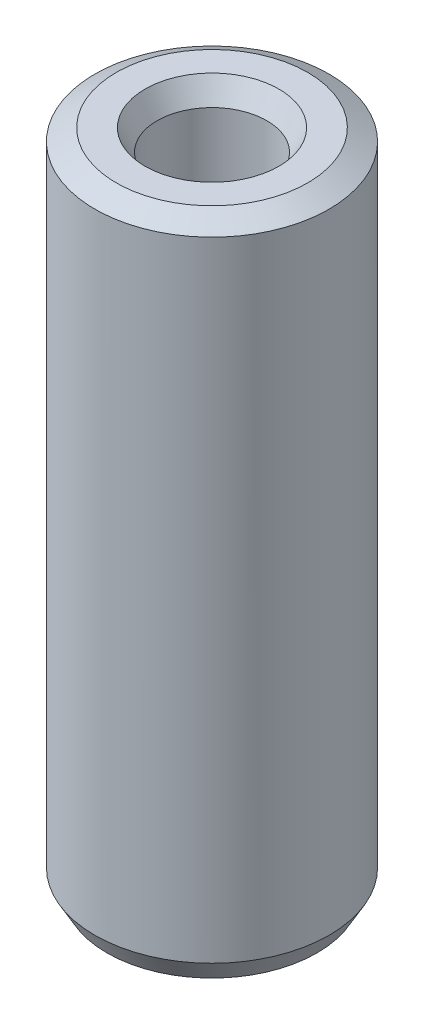
ISO-10303-21;
HEADER;
FILE_DESCRIPTION(('STEP AP214'),'2;1');
FILE_NAME('part.step','',(''),(''),'','','');
FILE_SCHEMA(('AUTOMOTIVE_DESIGN { 1 0 10303 214 1 1 1 1 }'));
ENDSEC;
DATA;
#1=APPLICATION_CONTEXT('core data for automotive mechanical design processes');
#2=APPLICATION_PROTOCOL_DEFINITION('international standard','automotive_design',2000,#1);
#3=PRODUCT_CONTEXT('',#1,'mechanical');
#4=PRODUCT('Part','Part','',(#3));
#5=PRODUCT_RELATED_PRODUCT_CATEGORY('part','',(#4));
#6=PRODUCT_DEFINITION_FORMATION('','',#4);
#7=PRODUCT_DEFINITION_CONTEXT('part definition',#1,'design');
#8=PRODUCT_DEFINITION('design','',#6,#7);
#9=PRODUCT_DEFINITION_SHAPE('','',#8);
#10=(LENGTH_UNIT() NAMED_UNIT(*) SI_UNIT(.MILLI.,.METRE.));
#11=(NAMED_UNIT(*) PLANE_ANGLE_UNIT() SI_UNIT($,.RADIAN.));
#12=(NAMED_UNIT(*) SI_UNIT($,.STERADIAN.) SOLID_ANGLE_UNIT());
#13=UNCERTAINTY_MEASURE_WITH_UNIT(LENGTH_MEASURE(1.E-05),#10,'distance_accuracy_value','');
#14=(GEOMETRIC_REPRESENTATION_CONTEXT(3) GLOBAL_UNCERTAINTY_ASSIGNED_CONTEXT((#13)) GLOBAL_UNIT_ASSIGNED_CONTEXT((#10,
#11,#12)) REPRESENTATION_CONTEXT('',''));
#15=CARTESIAN_POINT('',(0.,0.,0.));
#16=DIRECTION('',(0.,0.,1.));
#17=DIRECTION('',(1.,0.,0.));
#18=AXIS2_PLACEMENT_3D('',#15,#16,#17);
#19=CARTESIAN_POINT('',(0.,212.09904631612,0.));
#20=DIRECTION('',(0.,-1.,0.));
#21=DIRECTION('',(0.,0.,-1.));
#22=AXIS2_PLACEMENT_3D('',#19,#20,#21);
#23=CYLINDRICAL_SURFACE('',#22,37.5);
#24=CARTESIAN_POINT('',(0.,6.8413679712053,0.));
#25=DIRECTION('',(0.,1.,0.));
#26=DIRECTION('',(0.,0.,1.));
#27=AXIS2_PLACEMENT_3D('',#24,#25,#26);
#28=CIRCLE('',#27,37.5);
#29=CARTESIAN_POINT('',(0.,6.8413679712053,37.5));
#30=VERTEX_POINT('',#29);
#31=EDGE_CURVE('E10',#30,#30,#28,.T.);
#32=ORIENTED_EDGE('',*,*,#31,.T.);
#33=EDGE_LOOP('',(#32));
#34=FACE_BOUND('',#33,.T.);
#35=CARTESIAN_POINT('',(0.,208.230905599454,0.));
#36=DIRECTION('',(0.,1.,0.));
#37=DIRECTION('',(0.,0.,1.));
#38=AXIS2_PLACEMENT_3D('',#35,#36,#37);
#39=CIRCLE('',#38,37.5);
#40=CARTESIAN_POINT('',(0.,208.230905599454,-37.5));
#41=VERTEX_POINT('',#40);
#42=EDGE_CURVE('E50',#41,#41,#39,.F.);
#43=ORIENTED_EDGE('',*,*,#42,.T.);
#44=EDGE_LOOP('',(#43));
#45=FACE_BOUND('',#44,.T.);
#46=ADVANCED_FACE('F39',(#34,#45),#23,.T.);
#47=CARTESIAN_POINT('',(0.,212.09904631612,0.));
#48=DIRECTION('',(0.,1.,0.));
#49=DIRECTION('',(0.,0.,1.));
#50=AXIS2_PLACEMENT_3D('',#47,#48,#49);
#51=PLANE('',#50);
#52=CARTESIAN_POINT('',(0.,212.09904631612,0.));
#53=DIRECTION('',(0.,1.,0.));
#54=DIRECTION('',(0.,0.,1.));
#55=AXIS2_PLACEMENT_3D('',#52,#53,#54);
#56=CIRCLE('',#55,21.4346410003308);
#57=CARTESIAN_POINT('',(0.,212.09904631612,21.4346410003308));
#58=VERTEX_POINT('',#57);
#59=EDGE_CURVE('E58',#58,#58,#56,.F.);
#60=ORIENTED_EDGE('',*,*,#59,.T.);
#61=EDGE_LOOP('',(#60));
#62=FACE_BOUND('',#61,.T.);
#63=CARTESIAN_POINT('',(0.,212.09904631612,0.));
#64=DIRECTION('',(0.,1.,0.));
#65=DIRECTION('',(0.,0.,1.));
#66=AXIS2_PLACEMENT_3D('',#63,#64,#65);
#67=CIRCLE('',#66,30.6586320287946);
#68=CARTESIAN_POINT('',(0.,212.09904631612,-30.6586320287946));
#69=VERTEX_POINT('',#68);
#70=EDGE_CURVE('E61',#69,#69,#67,.T.);
#71=ORIENTED_EDGE('',*,*,#70,.T.);
#72=EDGE_LOOP('',(#71));
#73=FACE_BOUND('',#72,.T.);
#74=ADVANCED_FACE('F88',(#62,#73),#51,.T.);
#75=CARTESIAN_POINT('',(0.,0.,0.));
#76=DIRECTION('',(0.,1.,0.));
#77=DIRECTION('',(0.,0.,1.));
#78=AXIS2_PLACEMENT_3D('',#75,#76,#77);
#79=PLANE('',#78);
#80=CARTESIAN_POINT('',(0.,0.,0.));
#81=DIRECTION('',(0.,1.,0.));
#82=DIRECTION('',(0.,0.,1.));
#83=AXIS2_PLACEMENT_3D('',#80,#81,#82);
#84=CIRCLE('',#83,24.4078682548698);
#85=CARTESIAN_POINT('',(0.,0.,24.4078682548698));
#86=VERTEX_POINT('',#85);
#87=EDGE_CURVE('E51',#86,#86,#84,.T.);
#88=ORIENTED_EDGE('',*,*,#87,.T.);
#89=EDGE_LOOP('',(#88));
#90=FACE_BOUND('',#89,.T.);
#91=CARTESIAN_POINT('',(0.,0.,0.));
#92=DIRECTION('',(0.,1.,0.));
#93=DIRECTION('',(0.,0.,1.));
#94=AXIS2_PLACEMENT_3D('',#91,#92,#93);
#95=CIRCLE('',#94,33.6318592833337);
#96=CARTESIAN_POINT('',(0.,0.,33.6318592833337));
#97=VERTEX_POINT('',#96);
#98=EDGE_CURVE('E54',#97,#97,#95,.F.);
#99=ORIENTED_EDGE('',*,*,#98,.T.);
#100=EDGE_LOOP('',(#99));
#101=FACE_BOUND('',#100,.T.);
#102=ADVANCED_FACE('F83',(#90,#101),#79,.F.);
#103=CARTESIAN_POINT('',(0.,212.09904631612,0.));
#104=DIRECTION('',(0.,-1.,0.));
#105=DIRECTION('',(0.,0.,-1.));
#106=AXIS2_PLACEMENT_3D('',#103,#104,#105);
#107=CYLINDRICAL_SURFACE('',#106,17.5665002836644);
#108=CARTESIAN_POINT('',(0.,205.257678344915,0.));
#109=DIRECTION('',(0.,1.,0.));
#110=DIRECTION('',(0.,0.,1.));
#111=AXIS2_PLACEMENT_3D('',#108,#109,#110);
#112=CIRCLE('',#111,17.5665002836644);
#113=CARTESIAN_POINT('',(0.,205.257678344915,17.5665002836644));
#114=VERTEX_POINT('',#113);
#115=EDGE_CURVE('E67',#114,#114,#112,.T.);
#116=ORIENTED_EDGE('',*,*,#115,.T.);
#117=EDGE_LOOP('',(#116));
#118=FACE_BOUND('',#117,.T.);
#119=CARTESIAN_POINT('',(0.,3.86814071666636,0.));
#120=DIRECTION('',(0.,1.,0.));
#121=DIRECTION('',(0.,0.,1.));
#122=AXIS2_PLACEMENT_3D('',#119,#120,#121);
#123=CIRCLE('',#122,17.5665002836644);
#124=CARTESIAN_POINT('',(0.,3.86814071666636,17.5665002836644));
#125=VERTEX_POINT('',#124);
#126=EDGE_CURVE('E69',#125,#125,#123,.F.);
#127=ORIENTED_EDGE('',*,*,#126,.T.);
#128=EDGE_LOOP('',(#127));
#129=FACE_BOUND('',#128,.T.);
#130=ADVANCED_FACE('F71',(#118,#129),#107,.F.);
#131=CARTESIAN_POINT('',(0.,205.257678344915,0.));
#132=DIRECTION('',(0.,1.,0.));
#133=DIRECTION('',(0.,0.,1.));
#134=AXIS2_PLACEMENT_3D('',#131,#132,#133);
#135=CONICAL_SURFACE('',#134,17.5665002836644,0.514593160687077);
#136=ORIENTED_EDGE('',*,*,#59,.F.);
#137=EDGE_LOOP('',(#136));
#138=FACE_BOUND('',#137,.T.);
#139=ORIENTED_EDGE('',*,*,#115,.F.);
#140=EDGE_LOOP('',(#139));
#141=FACE_BOUND('',#140,.T.);
#142=ADVANCED_FACE('F77',(#138,#141),#135,.F.);
#143=CARTESIAN_POINT('',(0.,0.,0.));
#144=DIRECTION('',(0.,-1.,0.));
#145=DIRECTION('',(0.,0.,-1.));
#146=AXIS2_PLACEMENT_3D('',#143,#144,#145);
#147=CONICAL_SURFACE('',#146,24.4078682548698,1.05620316610781);
#148=ORIENTED_EDGE('',*,*,#126,.F.);
#149=EDGE_LOOP('',(#148));
#150=FACE_BOUND('',#149,.T.);
#151=ORIENTED_EDGE('',*,*,#87,.F.);
#152=EDGE_LOOP('',(#151));
#153=FACE_BOUND('',#152,.T.);
#154=ADVANCED_FACE('F73',(#150,#153),#147,.F.);
#155=CARTESIAN_POINT('',(0.,6.8413679712053,0.));
#156=DIRECTION('',(0.,1.,0.));
#157=DIRECTION('',(0.,0.,1.));
#158=AXIS2_PLACEMENT_3D('',#155,#156,#157);
#159=CONICAL_SURFACE('',#158,37.5,0.514593160687083);
#160=ORIENTED_EDGE('',*,*,#98,.F.);
#161=EDGE_LOOP('',(#160));
#162=FACE_BOUND('',#161,.T.);
#163=ORIENTED_EDGE('',*,*,#31,.F.);
#164=EDGE_LOOP('',(#163));
#165=FACE_BOUND('',#164,.T.);
#166=ADVANCED_FACE('F76',(#162,#165),#159,.T.);
#167=CARTESIAN_POINT('',(0.,212.09904631612,0.));
#168=DIRECTION('',(0.,-1.,0.));
#169=DIRECTION('',(0.,0.,-1.));
#170=AXIS2_PLACEMENT_3D('',#167,#168,#169);
#171=CONICAL_SURFACE('',#170,30.6586320287946,1.05620316610782);
#172=CARTESIAN_POINT('',(0.,208.230905599454,-37.5));
#173=CARTESIAN_POINT('',(0.,208.271198731919,-37.4287357503));
#174=CARTESIAN_POINT('',(0.,208.311491864384,-37.3574715005999));
#175=CARTESIAN_POINT('',(0.,208.392078129315,-37.2149430011998));
#176=CARTESIAN_POINT('',(0.,208.43237126178,-37.1436787514997));
#177=CARTESIAN_POINT('',(0.,208.512957526711,-37.0011502520996));
#178=CARTESIAN_POINT('',(0.,208.553250659176,-36.9298860023996));
#179=CARTESIAN_POINT('',(0.,208.633836924107,-36.7873575029995));
#180=CARTESIAN_POINT('',(0.,208.674130056572,-36.7160932532994));
#181=CARTESIAN_POINT('',(0.,208.754716321502,-36.5735647538993));
#182=CARTESIAN_POINT('',(0.,208.795009453968,-36.5023005041992));
#183=CARTESIAN_POINT('',(0.,208.875595718898,-36.3597720047991));
#184=CARTESIAN_POINT('',(0.,208.915888851364,-36.2885077550991));
#185=CARTESIAN_POINT('',(0.,208.996475116294,-36.145979255699));
#186=CARTESIAN_POINT('',(0.,209.036768248759,-36.0747150059989));
#187=CARTESIAN_POINT('',(0.,209.11735451369,-35.9321865065988));
#188=CARTESIAN_POINT('',(0.,209.157647646155,-35.8609222568987));
#189=CARTESIAN_POINT('',(0.,209.238233911086,-35.7183937574986));
#190=CARTESIAN_POINT('',(0.,209.278527043551,-35.6471295077986));
#191=CARTESIAN_POINT('',(0.,209.359113308482,-35.5046010083985));
#192=CARTESIAN_POINT('',(0.,209.399406440947,-35.4333367586984));
#193=CARTESIAN_POINT('',(0.,209.479992705877,-35.2908082592983));
#194=CARTESIAN_POINT('',(0.,209.520285838343,-35.2195440095982));
#195=CARTESIAN_POINT('',(0.,209.600872103273,-35.0770155101981));
#196=CARTESIAN_POINT('',(0.,209.641165235739,-35.0057512604981));
#197=CARTESIAN_POINT('',(0.,209.721751500669,-34.863222761098));
#198=CARTESIAN_POINT('',(0.,209.762044633134,-34.7919585113979));
#199=CARTESIAN_POINT('',(0.,209.842630898065,-34.6494300119978));
#200=CARTESIAN_POINT('',(0.,209.88292403053,-34.5781657622977));
#201=CARTESIAN_POINT('',(0.,209.963510295461,-34.4356372628976));
#202=CARTESIAN_POINT('',(0.,210.003803427926,-34.3643730131976));
#203=CARTESIAN_POINT('',(0.,210.084389692857,-34.2218445137975));
#204=CARTESIAN_POINT('',(0.,210.124682825322,-34.1505802640974));
#205=CARTESIAN_POINT('',(0.,210.205269090252,-34.0080517646973));
#206=CARTESIAN_POINT('',(0.,210.245562222718,-33.9367875149972));
#207=CARTESIAN_POINT('',(0.,210.326148487648,-33.7942590155971));
#208=CARTESIAN_POINT('',(0.,210.366441620113,-33.7229947658971));
#209=CARTESIAN_POINT('',(0.,210.447027885044,-33.580466266497));
#210=CARTESIAN_POINT('',(0.,210.487321017509,-33.5092020167969));
#211=CARTESIAN_POINT('',(0.,210.56790728244,-33.3666735173968));
#212=CARTESIAN_POINT('',(0.,210.608200414905,-33.2954092676967));
#213=CARTESIAN_POINT('',(0.,210.688786679836,-33.1528807682966));
#214=CARTESIAN_POINT('',(0.,210.729079812301,-33.0816165185966));
#215=CARTESIAN_POINT('',(0.,210.809666077231,-32.9390880191964));
#216=CARTESIAN_POINT('',(0.,210.849959209697,-32.8678237694964));
#217=CARTESIAN_POINT('',(0.,210.930545474627,-32.7252952700963));
#218=CARTESIAN_POINT('',(0.,210.970838607093,-32.6540310203962));
#219=CARTESIAN_POINT('',(0.,211.051424872023,-32.5115025209961));
#220=CARTESIAN_POINT('',(0.,211.091718004488,-32.4402382712961));
#221=CARTESIAN_POINT('',(0.,211.172304269419,-32.2977097718959));
#222=CARTESIAN_POINT('',(0.,211.212597401884,-32.2264455221959));
#223=CARTESIAN_POINT('',(0.,211.293183666815,-32.0839170227958));
#224=CARTESIAN_POINT('',(0.,211.33347679928,-32.0126527730957));
#225=CARTESIAN_POINT('',(0.,211.414063064211,-31.8701242736956));
#226=CARTESIAN_POINT('',(0.,211.454356196676,-31.7988600239956));
#227=CARTESIAN_POINT('',(0.,211.534942461606,-31.6563315245954));
#228=CARTESIAN_POINT('',(0.,211.575235594072,-31.5850672748954));
#229=CARTESIAN_POINT('',(0.,211.655821859002,-31.4425387754953));
#230=CARTESIAN_POINT('',(0.,211.696114991468,-31.3712745257952));
#231=CARTESIAN_POINT('',(0.,211.776701256398,-31.2287460263951));
#232=CARTESIAN_POINT('',(0.,211.816994388863,-31.157481776695));
#233=CARTESIAN_POINT('',(0.,211.897580653794,-31.0149532772949));
#234=CARTESIAN_POINT('',(0.,211.937873786259,-30.9436890275949));
#235=CARTESIAN_POINT('',(0.,212.01846005119,-30.8011605281948));
#236=CARTESIAN_POINT('',(0.,212.058753183655,-30.7298962784947));
#237=CARTESIAN_POINT('',(0.,212.09904631612,-30.6586320287946));
#238=B_SPLINE_CURVE_WITH_KNOTS('',3,(#172,#173,#174,#175,#176,#177,#178,#179,#180,#181,#182,
#183,#184,#185,#186,#187,#188,#189,#190,#191,#192,#193,#194,#195,#196,#197,#198,#199,#200,#201,
#202,#203,#204,#205,#206,#207,#208,#209,#210,#211,#212,#213,#214,#215,#216,#217,#218,#219,#220,
#221,#222,#223,#224,#225,#226,#227,#228,#229,#230,#231,#232,#233,#234,#235,#236,#237),
.UNSPECIFIED.,.F.,.F.,(4,2,2,2,2,2,2,2,2,2,2,2,2,2,2,2,2,2,2,2,2,2,2,2,2,2,2,2,2,2,2,2,4),(0.,
0.245599609695509,0.491199219391017,0.736798829086526,0.982398438782034,1.22799804847753,
1.47359765817304,1.71919726786855,1.96479687756405,2.21039648725956,2.45599609695506,
2.70159570665057,2.94719531634608,3.19279492604158,3.43839453573708,3.68399414543259,
3.9295937551281,4.1751933648236,4.42079297451911,4.66639258421461,4.91199219391012,
5.15759180360562,5.40319141330113,5.64879102299663,5.89439063269214,6.13999024238764,
6.38558985208315,6.63118946177866,6.87678907147416,7.12238868116966,7.36798829086518,
7.61358790056068,7.85918751025619),.UNSPECIFIED.);
#239=EDGE_CURVE('BSEAM45',#41,#69,#238,.T.);
#240=ORIENTED_EDGE('',*,*,#42,.F.);
#241=ORIENTED_EDGE('',*,*,#70,.F.);
#242=ORIENTED_EDGE('',*,*,#239,.T.);
#243=ORIENTED_EDGE('',*,*,#239,.F.);
#244=EDGE_LOOP('',(#240,#242,#241,#243));
#245=FACE_BOUND('',#244,.T.);
#246=ADVANCED_FACE('F45',(#245),#171,.T.);
#247=CLOSED_SHELL('',(#46,#74,#102,#130,#142,#154,#166,#246));
#248=MANIFOLD_SOLID_BREP('B2',#247);
#249=ADVANCED_BREP_SHAPE_REPRESENTATION('',(#18,#248),#14);
#250=SHAPE_DEFINITION_REPRESENTATION(#9,#249);
ENDSEC;
END-ISO-10303-21;
